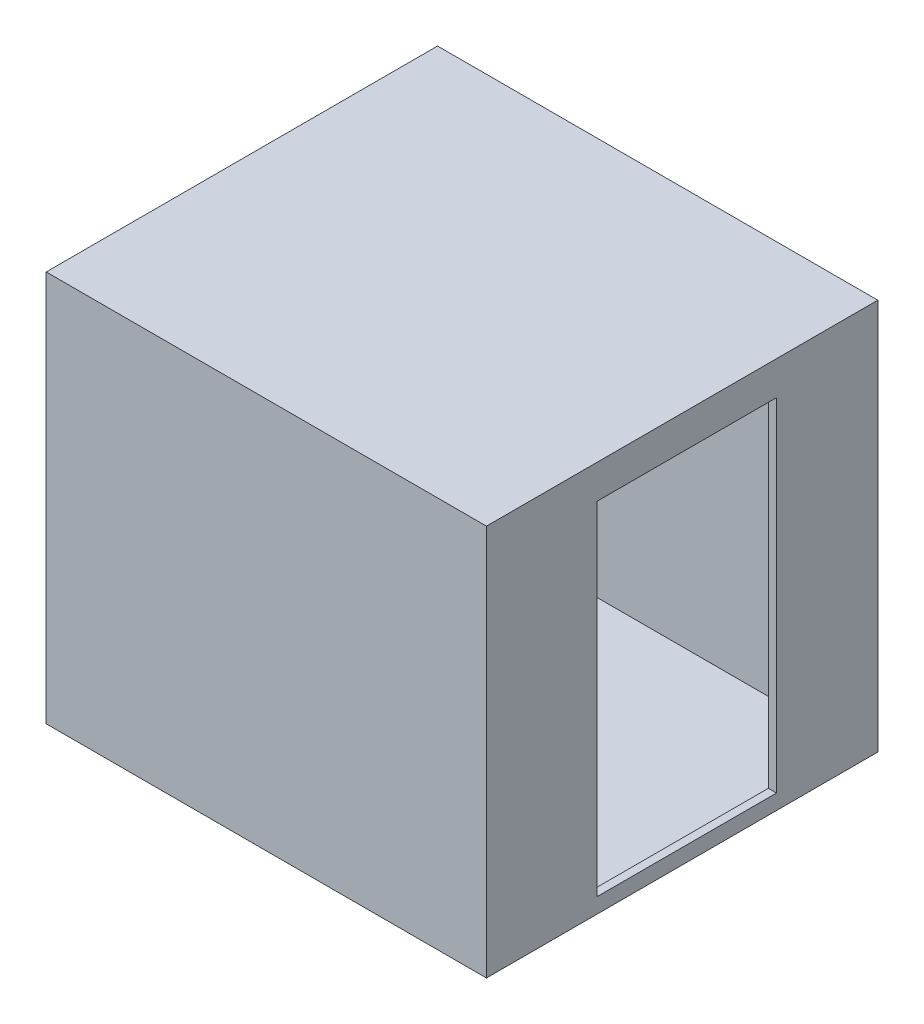
ISO-10303-21;
HEADER;
FILE_DESCRIPTION(('STEP AP214'),'2;1');
FILE_NAME('part.step','',(''),(''),'','','');
FILE_SCHEMA(('AUTOMOTIVE_DESIGN { 1 0 10303 214 1 1 1 1 }'));
ENDSEC;
DATA;
#1=APPLICATION_CONTEXT('core data for automotive mechanical design processes');
#2=APPLICATION_PROTOCOL_DEFINITION('international standard','automotive_design',2000,#1);
#3=PRODUCT_CONTEXT('',#1,'mechanical');
#4=PRODUCT('Part','Part','',(#3));
#5=PRODUCT_RELATED_PRODUCT_CATEGORY('part','',(#4));
#6=PRODUCT_DEFINITION_FORMATION('','',#4);
#7=PRODUCT_DEFINITION_CONTEXT('part definition',#1,'design');
#8=PRODUCT_DEFINITION('design','',#6,#7);
#9=PRODUCT_DEFINITION_SHAPE('','',#8);
#10=(LENGTH_UNIT() NAMED_UNIT(*) SI_UNIT(.MILLI.,.METRE.));
#11=(NAMED_UNIT(*) PLANE_ANGLE_UNIT() SI_UNIT($,.RADIAN.));
#12=(NAMED_UNIT(*) SI_UNIT($,.STERADIAN.) SOLID_ANGLE_UNIT());
#13=UNCERTAINTY_MEASURE_WITH_UNIT(LENGTH_MEASURE(1.E-05),#10,'distance_accuracy_value','');
#14=(GEOMETRIC_REPRESENTATION_CONTEXT(3) GLOBAL_UNCERTAINTY_ASSIGNED_CONTEXT((#13)) GLOBAL_UNIT_ASSIGNED_CONTEXT((#10,
#11,#12)) REPRESENTATION_CONTEXT('',''));
#15=CARTESIAN_POINT('',(0.,0.,0.));
#16=DIRECTION('',(0.,0.,1.));
#17=DIRECTION('',(1.,0.,0.));
#18=AXIS2_PLACEMENT_3D('',#15,#16,#17);
#19=CARTESIAN_POINT('',(-50.,2400.,0.));
#20=DIRECTION('',(1.,0.,0.));
#21=DIRECTION('',(0.,0.,-1.));
#22=AXIS2_PLACEMENT_3D('',#19,#20,#21);
#23=PLANE('',#22);
#24=DIRECTION('',(0.,0.,1.));
#25=VECTOR('',#24,1.);
#26=CARTESIAN_POINT('',(-50.,0.,0.));
#27=LINE('',#26,#25);
#28=CARTESIAN_POINT('',(-50.,0.,-2350.));
#29=VERTEX_POINT('',#28);
#30=CARTESIAN_POINT('',(-50.,0.,50.));
#31=VERTEX_POINT('',#30);
#32=EDGE_CURVE('E186',#29,#31,#27,.T.);
#33=ORIENTED_EDGE('',*,*,#32,.T.);
#34=DIRECTION('',(0.,-1.,0.));
#35=VECTOR('',#34,1.);
#36=CARTESIAN_POINT('',(-50.,2400.,50.));
#37=LINE('',#36,#35);
#38=CARTESIAN_POINT('',(-50.,2400.,50.));
#39=VERTEX_POINT('',#38);
#40=EDGE_CURVE('E11',#39,#31,#37,.T.);
#41=ORIENTED_EDGE('',*,*,#40,.F.);
#42=DIRECTION('',(0.,0.,1.));
#43=VECTOR('',#42,1.);
#44=CARTESIAN_POINT('',(-50.,2400.,0.));
#45=LINE('',#44,#43);
#46=CARTESIAN_POINT('',(-50.,2400.,-2350.));
#47=VERTEX_POINT('',#46);
#48=EDGE_CURVE('E187',#47,#39,#45,.T.);
#49=ORIENTED_EDGE('',*,*,#48,.F.);
#50=DIRECTION('',(0.,-1.,0.));
#51=VECTOR('',#50,1.);
#52=CARTESIAN_POINT('',(-50.,2400.,-2350.));
#53=LINE('',#52,#51);
#54=EDGE_CURVE('E197',#47,#29,#53,.T.);
#55=ORIENTED_EDGE('',*,*,#54,.T.);
#56=EDGE_LOOP('',(#33,#41,#49,#55));
#57=FACE_BOUND('',#56,.T.);
#58=ADVANCED_FACE('F32',(#57),#23,.F.);
#59=CARTESIAN_POINT('',(0.,2400.,50.));
#60=DIRECTION('',(0.,0.,-1.));
#61=DIRECTION('',(-1.,0.,0.));
#62=AXIS2_PLACEMENT_3D('',#59,#60,#61);
#63=PLANE('',#62);
#64=DIRECTION('',(1.,0.,0.));
#65=VECTOR('',#64,1.);
#66=CARTESIAN_POINT('',(0.,0.,50.));
#67=LINE('',#66,#65);
#68=CARTESIAN_POINT('',(2650.,0.,50.));
#69=VERTEX_POINT('',#68);
#70=EDGE_CURVE('E200',#31,#69,#67,.T.);
#71=ORIENTED_EDGE('',*,*,#70,.T.);
#72=DIRECTION('',(0.,-1.,0.));
#73=VECTOR('',#72,1.);
#74=CARTESIAN_POINT('',(2650.,2400.,50.));
#75=LINE('',#74,#73);
#76=CARTESIAN_POINT('',(2650.,2400.,50.));
#77=VERTEX_POINT('',#76);
#78=EDGE_CURVE('E39',#77,#69,#75,.T.);
#79=ORIENTED_EDGE('',*,*,#78,.F.);
#80=DIRECTION('',(1.,0.,0.));
#81=VECTOR('',#80,1.);
#82=CARTESIAN_POINT('',(0.,2400.,50.));
#83=LINE('',#82,#81);
#84=EDGE_CURVE('E190',#39,#77,#83,.T.);
#85=ORIENTED_EDGE('',*,*,#84,.F.);
#86=ORIENTED_EDGE('',*,*,#40,.T.);
#87=EDGE_LOOP('',(#71,#79,#85,#86));
#88=FACE_BOUND('',#87,.T.);
#89=ADVANCED_FACE('F230',(#88),#63,.F.);
#90=CARTESIAN_POINT('',(2650.,2400.,0.));
#91=DIRECTION('',(-1.,0.,0.));
#92=DIRECTION('',(0.,0.,1.));
#93=AXIS2_PLACEMENT_3D('',#90,#91,#92);
#94=PLANE('',#93);
#95=DIRECTION('',(0.,1.,0.));
#96=VECTOR('',#95,1.);
#97=CARTESIAN_POINT('',(2650.,2193.01225567537,-1728.58283806164));
#98=LINE('',#97,#96);
#99=CARTESIAN_POINT('',(2650.,93.0122556753693,-1728.58283806164));
#100=VERTEX_POINT('',#99);
#101=CARTESIAN_POINT('',(2650.,2193.01225567537,-1728.58283806164));
#102=VERTEX_POINT('',#101);
#103=EDGE_CURVE('E135',#100,#102,#98,.T.);
#104=ORIENTED_EDGE('',*,*,#103,.F.);
#105=DIRECTION('',(0.,0.,-1.));
#106=VECTOR('',#105,1.);
#107=CARTESIAN_POINT('',(2650.,93.0122556753693,-628.582838061637));
#108=LINE('',#107,#106);
#109=CARTESIAN_POINT('',(2650.,93.0122556753693,-628.582838061637));
#110=VERTEX_POINT('',#109);
#111=EDGE_CURVE('E147',#110,#100,#108,.T.);
#112=ORIENTED_EDGE('',*,*,#111,.F.);
#113=DIRECTION('',(0.,-1.,0.));
#114=VECTOR('',#113,1.);
#115=CARTESIAN_POINT('',(2650.,2193.01225567537,-628.582838061636));
#116=LINE('',#115,#114);
#117=CARTESIAN_POINT('',(2650.,2193.01225567537,-628.582838061636));
#118=VERTEX_POINT('',#117);
#119=EDGE_CURVE('E145',#118,#110,#116,.T.);
#120=ORIENTED_EDGE('',*,*,#119,.F.);
#121=DIRECTION('',(0.,0.,1.));
#122=VECTOR('',#121,1.);
#123=CARTESIAN_POINT('',(2650.,2193.01225567537,-628.582838061636));
#124=LINE('',#123,#122);
#125=EDGE_CURVE('E46',#102,#118,#124,.T.);
#126=ORIENTED_EDGE('',*,*,#125,.F.);
#127=EDGE_LOOP('',(#104,#112,#120,#126));
#128=FACE_BOUND('',#127,.T.);
#129=DIRECTION('',(0.,0.,-1.));
#130=VECTOR('',#129,1.);
#131=CARTESIAN_POINT('',(2650.,0.,0.));
#132=LINE('',#131,#130);
#133=CARTESIAN_POINT('',(2650.,0.,-2350.));
#134=VERTEX_POINT('',#133);
#135=EDGE_CURVE('E202',#69,#134,#132,.T.);
#136=ORIENTED_EDGE('',*,*,#135,.T.);
#137=DIRECTION('',(0.,-1.,0.));
#138=VECTOR('',#137,1.);
#139=CARTESIAN_POINT('',(2650.,2400.,-2350.));
#140=LINE('',#139,#138);
#141=CARTESIAN_POINT('',(2650.,2400.,-2350.));
#142=VERTEX_POINT('',#141);
#143=EDGE_CURVE('E207',#142,#134,#140,.T.);
#144=ORIENTED_EDGE('',*,*,#143,.F.);
#145=DIRECTION('',(0.,0.,-1.));
#146=VECTOR('',#145,1.);
#147=CARTESIAN_POINT('',(2650.,2400.,0.));
#148=LINE('',#147,#146);
#149=EDGE_CURVE('E193',#77,#142,#148,.T.);
#150=ORIENTED_EDGE('',*,*,#149,.F.);
#151=ORIENTED_EDGE('',*,*,#78,.T.);
#152=EDGE_LOOP('',(#136,#144,#150,#151));
#153=FACE_BOUND('',#152,.T.);
#154=ADVANCED_FACE('F214',(#128,#153),#94,.F.);
#155=CARTESIAN_POINT('',(0.,2400.,-2350.));
#156=DIRECTION('',(0.,0.,1.));
#157=DIRECTION('',(1.,0.,0.));
#158=AXIS2_PLACEMENT_3D('',#155,#156,#157);
#159=PLANE('',#158);
#160=DIRECTION('',(-1.,0.,0.));
#161=VECTOR('',#160,1.);
#162=CARTESIAN_POINT('',(0.,0.,-2350.));
#163=LINE('',#162,#161);
#164=EDGE_CURVE('E191',#134,#29,#163,.T.);
#165=ORIENTED_EDGE('',*,*,#164,.T.);
#166=ORIENTED_EDGE('',*,*,#54,.F.);
#167=DIRECTION('',(-1.,0.,0.));
#168=VECTOR('',#167,1.);
#169=CARTESIAN_POINT('',(0.,2400.,-2350.));
#170=LINE('',#169,#168);
#171=EDGE_CURVE('E195',#142,#47,#170,.T.);
#172=ORIENTED_EDGE('',*,*,#171,.F.);
#173=ORIENTED_EDGE('',*,*,#143,.T.);
#174=EDGE_LOOP('',(#165,#166,#172,#173));
#175=FACE_BOUND('',#174,.T.);
#176=ADVANCED_FACE('F223',(#175),#159,.F.);
#177=CARTESIAN_POINT('',(0.,2400.,0.));
#178=DIRECTION('',(0.,1.,0.));
#179=DIRECTION('',(0.,0.,1.));
#180=AXIS2_PLACEMENT_3D('',#177,#178,#179);
#181=PLANE('',#180);
#182=ORIENTED_EDGE('',*,*,#48,.T.);
#183=ORIENTED_EDGE('',*,*,#84,.T.);
#184=ORIENTED_EDGE('',*,*,#149,.T.);
#185=ORIENTED_EDGE('',*,*,#171,.T.);
#186=EDGE_LOOP('',(#182,#183,#184,#185));
#187=FACE_BOUND('',#186,.T.);
#188=ADVANCED_FACE('F229',(#187),#181,.T.);
#189=CARTESIAN_POINT('',(0.,0.,0.));
#190=DIRECTION('',(0.,1.,0.));
#191=DIRECTION('',(0.,0.,1.));
#192=AXIS2_PLACEMENT_3D('',#189,#190,#191);
#193=PLANE('',#192);
#194=ORIENTED_EDGE('',*,*,#32,.F.);
#195=ORIENTED_EDGE('',*,*,#164,.F.);
#196=ORIENTED_EDGE('',*,*,#135,.F.);
#197=ORIENTED_EDGE('',*,*,#70,.F.);
#198=EDGE_LOOP('',(#194,#195,#196,#197));
#199=FACE_BOUND('',#198,.T.);
#200=ADVANCED_FACE('F220',(#199),#193,.F.);
#201=CARTESIAN_POINT('',(-50.001,93.0122556753693,-628.582838061637));
#202=DIRECTION('',(0.,-1.,0.));
#203=DIRECTION('',(0.,0.,-1.));
#204=AXIS2_PLACEMENT_3D('',#201,#202,#203);
#205=PLANE('',#204);
#206=DIRECTION('',(1.,0.,0.));
#207=VECTOR('',#206,1.);
#208=CARTESIAN_POINT('',(-50.001,93.0122556753693,-628.582838061637));
#209=LINE('',#208,#207);
#210=CARTESIAN_POINT('',(2600.,93.0122556753696,-628.582838061637));
#211=VERTEX_POINT('',#210);
#212=EDGE_CURVE('E54',#211,#110,#209,.T.);
#213=ORIENTED_EDGE('',*,*,#212,.T.);
#214=ORIENTED_EDGE('',*,*,#111,.T.);
#215=DIRECTION('',(1.,0.,0.));
#216=VECTOR('',#215,1.);
#217=CARTESIAN_POINT('',(-50.001,93.0122556753693,-1728.58283806164));
#218=LINE('',#217,#216);
#219=CARTESIAN_POINT('',(2600.,93.0122556753693,-1728.58283806164));
#220=VERTEX_POINT('',#219);
#221=EDGE_CURVE('E136',#220,#100,#218,.T.);
#222=ORIENTED_EDGE('',*,*,#221,.F.);
#223=DIRECTION('',(0.,0.,-1.));
#224=VECTOR('',#223,1.);
#225=CARTESIAN_POINT('',(2600.,93.0122556753693,-628.582838061637));
#226=LINE('',#225,#224);
#227=EDGE_CURVE('E141',#211,#220,#226,.T.);
#228=ORIENTED_EDGE('',*,*,#227,.F.);
#229=EDGE_LOOP('',(#213,#214,#222,#228));
#230=FACE_BOUND('',#229,.T.);
#231=ADVANCED_FACE('F243',(#230),#205,.F.);
#232=CARTESIAN_POINT('',(-50.001,2193.01225567537,-1728.58283806164));
#233=DIRECTION('',(0.,0.,-1.));
#234=DIRECTION('',(0.,1.,0.));
#235=AXIS2_PLACEMENT_3D('',#232,#233,#234);
#236=PLANE('',#235);
#237=ORIENTED_EDGE('',*,*,#221,.T.);
#238=ORIENTED_EDGE('',*,*,#103,.T.);
#239=DIRECTION('',(1.,0.,0.));
#240=VECTOR('',#239,1.);
#241=CARTESIAN_POINT('',(-50.001,2193.01225567537,-1728.58283806164));
#242=LINE('',#241,#240);
#243=CARTESIAN_POINT('',(2600.,2193.01225567537,-1728.58283806164));
#244=VERTEX_POINT('',#243);
#245=EDGE_CURVE('E122',#244,#102,#242,.T.);
#246=ORIENTED_EDGE('',*,*,#245,.F.);
#247=DIRECTION('',(0.,1.,0.));
#248=VECTOR('',#247,1.);
#249=CARTESIAN_POINT('',(2600.,2193.01225567537,-1728.58283806164));
#250=LINE('',#249,#248);
#251=EDGE_CURVE('E129',#220,#244,#250,.T.);
#252=ORIENTED_EDGE('',*,*,#251,.F.);
#253=EDGE_LOOP('',(#237,#238,#246,#252));
#254=FACE_BOUND('',#253,.T.);
#255=ADVANCED_FACE('F132',(#254),#236,.F.);
#256=CARTESIAN_POINT('',(-50.001,2193.01225567537,-628.582838061636));
#257=DIRECTION('',(0.,1.,0.));
#258=DIRECTION('',(0.,0.,1.));
#259=AXIS2_PLACEMENT_3D('',#256,#257,#258);
#260=PLANE('',#259);
#261=ORIENTED_EDGE('',*,*,#245,.T.);
#262=ORIENTED_EDGE('',*,*,#125,.T.);
#263=DIRECTION('',(1.,0.,0.));
#264=VECTOR('',#263,1.);
#265=CARTESIAN_POINT('',(-50.001,2193.01225567537,-628.582838061636));
#266=LINE('',#265,#264);
#267=CARTESIAN_POINT('',(2600.,2193.01225567537,-628.582838061636));
#268=VERTEX_POINT('',#267);
#269=EDGE_CURVE('E124',#268,#118,#266,.T.);
#270=ORIENTED_EDGE('',*,*,#269,.F.);
#271=DIRECTION('',(0.,0.,1.));
#272=VECTOR('',#271,1.);
#273=CARTESIAN_POINT('',(2600.,2193.01225567537,-628.582838061636));
#274=LINE('',#273,#272);
#275=EDGE_CURVE('E119',#244,#268,#274,.T.);
#276=ORIENTED_EDGE('',*,*,#275,.F.);
#277=EDGE_LOOP('',(#261,#262,#270,#276));
#278=FACE_BOUND('',#277,.T.);
#279=ADVANCED_FACE('F121',(#278),#260,.F.);
#280=CARTESIAN_POINT('',(-50.001,2193.01225567537,-628.582838061636));
#281=DIRECTION('',(0.,0.,1.));
#282=DIRECTION('',(0.,-1.,0.));
#283=AXIS2_PLACEMENT_3D('',#280,#281,#282);
#284=PLANE('',#283);
#285=ORIENTED_EDGE('',*,*,#269,.T.);
#286=ORIENTED_EDGE('',*,*,#119,.T.);
#287=ORIENTED_EDGE('',*,*,#212,.F.);
#288=DIRECTION('',(0.,-1.,0.));
#289=VECTOR('',#288,1.);
#290=CARTESIAN_POINT('',(2600.,2193.01225567537,-628.582838061636));
#291=LINE('',#290,#289);
#292=EDGE_CURVE('E128',#268,#211,#291,.T.);
#293=ORIENTED_EDGE('',*,*,#292,.F.);
#294=EDGE_LOOP('',(#285,#286,#287,#293));
#295=FACE_BOUND('',#294,.T.);
#296=ADVANCED_FACE('F250',(#295),#284,.F.);
#297=CARTESIAN_POINT('',(0.,2390.,0.));
#298=DIRECTION('',(1.,0.,0.));
#299=DIRECTION('',(0.,0.,-1.));
#300=AXIS2_PLACEMENT_3D('',#297,#298,#299);
#301=PLANE('',#300);
#302=DIRECTION('',(0.,0.,1.));
#303=VECTOR('',#302,1.);
#304=CARTESIAN_POINT('',(0.,10.,0.));
#305=LINE('',#304,#303);
#306=CARTESIAN_POINT('',(0.,10.,-2300.));
#307=VERTEX_POINT('',#306);
#308=CARTESIAN_POINT('',(0.,10.,0.));
#309=VERTEX_POINT('',#308);
#310=EDGE_CURVE('E156',#307,#309,#305,.T.);
#311=ORIENTED_EDGE('',*,*,#310,.F.);
#312=DIRECTION('',(0.,-1.,0.));
#313=VECTOR('',#312,1.);
#314=CARTESIAN_POINT('',(0.,2390.,-2300.));
#315=LINE('',#314,#313);
#316=CARTESIAN_POINT('',(0.,2390.,-2300.));
#317=VERTEX_POINT('',#316);
#318=EDGE_CURVE('E167',#317,#307,#315,.T.);
#319=ORIENTED_EDGE('',*,*,#318,.F.);
#320=DIRECTION('',(0.,0.,1.));
#321=VECTOR('',#320,1.);
#322=CARTESIAN_POINT('',(0.,2390.,0.));
#323=LINE('',#322,#321);
#324=CARTESIAN_POINT('',(0.,2390.,0.));
#325=VERTEX_POINT('',#324);
#326=EDGE_CURVE('E157',#317,#325,#323,.T.);
#327=ORIENTED_EDGE('',*,*,#326,.T.);
#328=DIRECTION('',(0.,-1.,0.));
#329=VECTOR('',#328,1.);
#330=CARTESIAN_POINT('',(0.,2390.,0.));
#331=LINE('',#330,#329);
#332=EDGE_CURVE('E183',#325,#309,#331,.T.);
#333=ORIENTED_EDGE('',*,*,#332,.T.);
#334=EDGE_LOOP('',(#311,#319,#327,#333));
#335=FACE_BOUND('',#334,.T.);
#336=ADVANCED_FACE('F246',(#335),#301,.T.);
#337=CARTESIAN_POINT('',(0.,2390.,0.));
#338=DIRECTION('',(0.,0.,-1.));
#339=DIRECTION('',(-1.,0.,0.));
#340=AXIS2_PLACEMENT_3D('',#337,#338,#339);
#341=PLANE('',#340);
#342=DIRECTION('',(1.,0.,0.));
#343=VECTOR('',#342,1.);
#344=CARTESIAN_POINT('',(0.,10.,0.));
#345=LINE('',#344,#343);
#346=CARTESIAN_POINT('',(2600.,10.,0.));
#347=VERTEX_POINT('',#346);
#348=EDGE_CURVE('E170',#309,#347,#345,.T.);
#349=ORIENTED_EDGE('',*,*,#348,.F.);
#350=ORIENTED_EDGE('',*,*,#332,.F.);
#351=DIRECTION('',(1.,0.,0.));
#352=VECTOR('',#351,1.);
#353=CARTESIAN_POINT('',(0.,2390.,0.));
#354=LINE('',#353,#352);
#355=CARTESIAN_POINT('',(2600.,2390.,0.));
#356=VERTEX_POINT('',#355);
#357=EDGE_CURVE('E160',#325,#356,#354,.T.);
#358=ORIENTED_EDGE('',*,*,#357,.T.);
#359=DIRECTION('',(0.,-1.,0.));
#360=VECTOR('',#359,1.);
#361=CARTESIAN_POINT('',(2600.,2390.,0.));
#362=LINE('',#361,#360);
#363=EDGE_CURVE('E180',#356,#347,#362,.T.);
#364=ORIENTED_EDGE('',*,*,#363,.T.);
#365=EDGE_LOOP('',(#349,#350,#358,#364));
#366=FACE_BOUND('',#365,.T.);
#367=ADVANCED_FACE('F249',(#366),#341,.T.);
#368=CARTESIAN_POINT('',(2600.,2390.,0.));
#369=DIRECTION('',(-1.,0.,0.));
#370=DIRECTION('',(0.,0.,1.));
#371=AXIS2_PLACEMENT_3D('',#368,#369,#370);
#372=PLANE('',#371);
#373=ORIENTED_EDGE('',*,*,#227,.T.);
#374=ORIENTED_EDGE('',*,*,#251,.T.);
#375=ORIENTED_EDGE('',*,*,#275,.T.);
#376=ORIENTED_EDGE('',*,*,#292,.T.);
#377=EDGE_LOOP('',(#373,#374,#375,#376));
#378=FACE_BOUND('',#377,.T.);
#379=DIRECTION('',(0.,0.,-1.));
#380=VECTOR('',#379,1.);
#381=CARTESIAN_POINT('',(2600.,10.,0.));
#382=LINE('',#381,#380);
#383=CARTESIAN_POINT('',(2600.,10.,-2300.));
#384=VERTEX_POINT('',#383);
#385=EDGE_CURVE('E172',#347,#384,#382,.T.);
#386=ORIENTED_EDGE('',*,*,#385,.F.);
#387=ORIENTED_EDGE('',*,*,#363,.F.);
#388=DIRECTION('',(0.,0.,-1.));
#389=VECTOR('',#388,1.);
#390=CARTESIAN_POINT('',(2600.,2390.,0.));
#391=LINE('',#390,#389);
#392=CARTESIAN_POINT('',(2600.,2390.,-2300.));
#393=VERTEX_POINT('',#392);
#394=EDGE_CURVE('E163',#356,#393,#391,.T.);
#395=ORIENTED_EDGE('',*,*,#394,.T.);
#396=DIRECTION('',(0.,-1.,0.));
#397=VECTOR('',#396,1.);
#398=CARTESIAN_POINT('',(2600.,2390.,-2300.));
#399=LINE('',#398,#397);
#400=EDGE_CURVE('E177',#393,#384,#399,.T.);
#401=ORIENTED_EDGE('',*,*,#400,.T.);
#402=EDGE_LOOP('',(#386,#387,#395,#401));
#403=FACE_BOUND('',#402,.T.);
#404=ADVANCED_FACE('F139',(#378,#403),#372,.T.);
#405=CARTESIAN_POINT('',(0.,2390.,-2300.));
#406=DIRECTION('',(0.,0.,1.));
#407=DIRECTION('',(1.,0.,0.));
#408=AXIS2_PLACEMENT_3D('',#405,#406,#407);
#409=PLANE('',#408);
#410=DIRECTION('',(-1.,0.,0.));
#411=VECTOR('',#410,1.);
#412=CARTESIAN_POINT('',(0.,10.,-2300.));
#413=LINE('',#412,#411);
#414=EDGE_CURVE('E161',#384,#307,#413,.T.);
#415=ORIENTED_EDGE('',*,*,#414,.F.);
#416=ORIENTED_EDGE('',*,*,#400,.F.);
#417=DIRECTION('',(-1.,0.,0.));
#418=VECTOR('',#417,1.);
#419=CARTESIAN_POINT('',(0.,2390.,-2300.));
#420=LINE('',#419,#418);
#421=EDGE_CURVE('E165',#393,#317,#420,.T.);
#422=ORIENTED_EDGE('',*,*,#421,.T.);
#423=ORIENTED_EDGE('',*,*,#318,.T.);
#424=EDGE_LOOP('',(#415,#416,#422,#423));
#425=FACE_BOUND('',#424,.T.);
#426=ADVANCED_FACE('F257',(#425),#409,.T.);
#427=CARTESIAN_POINT('',(0.,2390.,0.));
#428=DIRECTION('',(0.,1.,0.));
#429=DIRECTION('',(0.,0.,1.));
#430=AXIS2_PLACEMENT_3D('',#427,#428,#429);
#431=PLANE('',#430);
#432=ORIENTED_EDGE('',*,*,#326,.F.);
#433=ORIENTED_EDGE('',*,*,#421,.F.);
#434=ORIENTED_EDGE('',*,*,#394,.F.);
#435=ORIENTED_EDGE('',*,*,#357,.F.);
#436=EDGE_LOOP('',(#432,#433,#434,#435));
#437=FACE_BOUND('',#436,.T.);
#438=ADVANCED_FACE('F260',(#437),#431,.F.);
#439=CARTESIAN_POINT('',(0.,10.,0.));
#440=DIRECTION('',(0.,1.,0.));
#441=DIRECTION('',(0.,0.,1.));
#442=AXIS2_PLACEMENT_3D('',#439,#440,#441);
#443=PLANE('',#442);
#444=ORIENTED_EDGE('',*,*,#310,.T.);
#445=ORIENTED_EDGE('',*,*,#348,.T.);
#446=ORIENTED_EDGE('',*,*,#385,.T.);
#447=ORIENTED_EDGE('',*,*,#414,.T.);
#448=EDGE_LOOP('',(#444,#445,#446,#447));
#449=FACE_BOUND('',#448,.T.);
#450=ADVANCED_FACE('F262',(#449),#443,.T.);
#451=CLOSED_SHELL('',(#58,#89,#154,#176,#188,#200,#231,#255,#279,#296,#336,#367,#404,#426,#438,#450));
#452=MANIFOLD_SOLID_BREP('B2',#451);
#453=ADVANCED_BREP_SHAPE_REPRESENTATION('',(#18,#452),#14);
#454=SHAPE_DEFINITION_REPRESENTATION(#9,#453);
ENDSEC;
END-ISO-10303-21;
